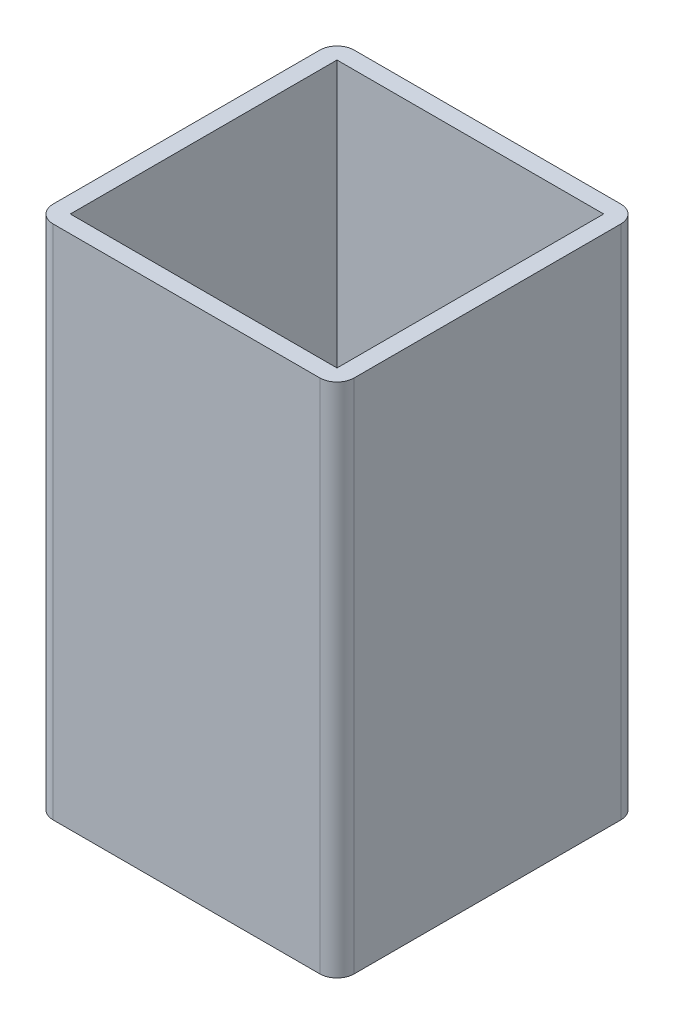
ISO-10303-21;
HEADER;
FILE_DESCRIPTION(('STEP AP214'),'2;1');
FILE_NAME('part.step','',(''),(''),'','','');
FILE_SCHEMA(('AUTOMOTIVE_DESIGN { 1 0 10303 214 1 1 1 1 }'));
ENDSEC;
DATA;
#1=APPLICATION_CONTEXT('core data for automotive mechanical design processes');
#2=APPLICATION_PROTOCOL_DEFINITION('international standard','automotive_design',2000,#1);
#3=PRODUCT_CONTEXT('',#1,'mechanical');
#4=PRODUCT('Part','Part','',(#3));
#5=PRODUCT_RELATED_PRODUCT_CATEGORY('part','',(#4));
#6=PRODUCT_DEFINITION_FORMATION('','',#4);
#7=PRODUCT_DEFINITION_CONTEXT('part definition',#1,'design');
#8=PRODUCT_DEFINITION('design','',#6,#7);
#9=PRODUCT_DEFINITION_SHAPE('','',#8);
#10=(LENGTH_UNIT() NAMED_UNIT(*) SI_UNIT(.MILLI.,.METRE.));
#11=(NAMED_UNIT(*) PLANE_ANGLE_UNIT() SI_UNIT($,.RADIAN.));
#12=(NAMED_UNIT(*) SI_UNIT($,.STERADIAN.) SOLID_ANGLE_UNIT());
#13=UNCERTAINTY_MEASURE_WITH_UNIT(LENGTH_MEASURE(1.E-05),#10,'distance_accuracy_value','');
#14=(GEOMETRIC_REPRESENTATION_CONTEXT(3) GLOBAL_UNCERTAINTY_ASSIGNED_CONTEXT((#13)) GLOBAL_UNIT_ASSIGNED_CONTEXT((#10,
#11,#12)) REPRESENTATION_CONTEXT('',''));
#15=CARTESIAN_POINT('',(0.,0.,0.));
#16=DIRECTION('',(0.,0.,1.));
#17=DIRECTION('',(1.,0.,0.));
#18=AXIS2_PLACEMENT_3D('',#15,#16,#17);
#19=CARTESIAN_POINT('',(7.5,60.,-17.5));
#20=DIRECTION('',(0.,-1.,0.));
#21=DIRECTION('',(0.,0.,-1.));
#22=AXIS2_PLACEMENT_3D('',#19,#20,#21);
#23=CYLINDRICAL_SURFACE('',#22,4.75);
#24=CARTESIAN_POINT('',(7.5,0.,-17.5));
#25=DIRECTION('',(0.,1.,0.));
#26=DIRECTION('',(0.,0.,1.));
#27=AXIS2_PLACEMENT_3D('',#24,#25,#26);
#28=CIRCLE('',#27,4.75);
#29=CARTESIAN_POINT('',(7.5,0.,-12.75));
#30=VERTEX_POINT('',#29);
#31=EDGE_CURVE('E155',#30,#30,#28,.T.);
#32=ORIENTED_EDGE('',*,*,#31,.F.);
#33=EDGE_LOOP('',(#32));
#34=FACE_BOUND('',#33,.T.);
#35=CARTESIAN_POINT('',(7.5,5.,-17.5));
#36=DIRECTION('',(0.,1.,0.));
#37=DIRECTION('',(0.,0.,1.));
#38=AXIS2_PLACEMENT_3D('',#35,#36,#37);
#39=CIRCLE('',#38,4.75);
#40=CARTESIAN_POINT('',(7.5,5.,-12.75));
#41=VERTEX_POINT('',#40);
#42=EDGE_CURVE('E207',#41,#41,#39,.T.);
#43=ORIENTED_EDGE('',*,*,#42,.T.);
#44=EDGE_LOOP('',(#43));
#45=FACE_BOUND('',#44,.T.);
#46=ADVANCED_FACE('F41',(#34,#45),#23,.F.);
#47=CARTESIAN_POINT('',(27.5,60.,-17.5));
#48=DIRECTION('',(0.,-1.,0.));
#49=DIRECTION('',(0.,0.,-1.));
#50=AXIS2_PLACEMENT_3D('',#47,#48,#49);
#51=CYLINDRICAL_SURFACE('',#50,4.75);
#52=CARTESIAN_POINT('',(27.5,0.,-17.5));
#53=DIRECTION('',(0.,1.,0.));
#54=DIRECTION('',(0.,0.,-1.));
#55=AXIS2_PLACEMENT_3D('',#52,#53,#54);
#56=CIRCLE('',#55,4.75);
#57=CARTESIAN_POINT('',(27.5,0.,-22.25));
#58=VERTEX_POINT('',#57);
#59=EDGE_CURVE('E204',#58,#58,#56,.T.);
#60=ORIENTED_EDGE('',*,*,#59,.F.);
#61=EDGE_LOOP('',(#60));
#62=FACE_BOUND('',#61,.T.);
#63=CARTESIAN_POINT('',(27.5,5.,-17.5));
#64=DIRECTION('',(0.,1.,0.));
#65=DIRECTION('',(0.,0.,1.));
#66=AXIS2_PLACEMENT_3D('',#63,#64,#65);
#67=CIRCLE('',#66,4.75);
#68=CARTESIAN_POINT('',(27.5,5.,-12.75));
#69=VERTEX_POINT('',#68);
#70=EDGE_CURVE('E45',#69,#69,#67,.T.);
#71=ORIENTED_EDGE('',*,*,#70,.T.);
#72=EDGE_LOOP('',(#71));
#73=FACE_BOUND('',#72,.T.);
#74=ADVANCED_FACE('F282',(#62,#73),#51,.F.);
#75=CARTESIAN_POINT('',(2.,60.,-33.));
#76=DIRECTION('',(0.,1.,0.));
#77=DIRECTION('',(0.,0.,1.));
#78=AXIS2_PLACEMENT_3D('',#75,#76,#77);
#79=PLANE('',#78);
#80=DIRECTION('',(-1.,0.,0.));
#81=VECTOR('',#80,1.);
#82=CARTESIAN_POINT('',(33.,60.,-33.));
#83=LINE('',#82,#81);
#84=CARTESIAN_POINT('',(33.,60.,-33.));
#85=VERTEX_POINT('',#84);
#86=CARTESIAN_POINT('',(2.,60.,-33.));
#87=VERTEX_POINT('',#86);
#88=EDGE_CURVE('E57',#85,#87,#83,.T.);
#89=ORIENTED_EDGE('',*,*,#88,.F.);
#90=DIRECTION('',(0.,0.,-1.));
#91=VECTOR('',#90,1.);
#92=CARTESIAN_POINT('',(33.,60.,-2.));
#93=LINE('',#92,#91);
#94=CARTESIAN_POINT('',(33.,60.,-2.));
#95=VERTEX_POINT('',#94);
#96=EDGE_CURVE('E217',#95,#85,#93,.T.);
#97=ORIENTED_EDGE('',*,*,#96,.F.);
#98=DIRECTION('',(1.,0.,0.));
#99=VECTOR('',#98,1.);
#100=CARTESIAN_POINT('',(2.,60.,-2.));
#101=LINE('',#100,#99);
#102=CARTESIAN_POINT('',(2.,60.,-2.));
#103=VERTEX_POINT('',#102);
#104=EDGE_CURVE('E228',#103,#95,#101,.T.);
#105=ORIENTED_EDGE('',*,*,#104,.F.);
#106=DIRECTION('',(0.,0.,1.));
#107=VECTOR('',#106,1.);
#108=CARTESIAN_POINT('',(2.,60.,-33.));
#109=LINE('',#108,#107);
#110=EDGE_CURVE('E231',#87,#103,#109,.T.);
#111=ORIENTED_EDGE('',*,*,#110,.F.);
#112=EDGE_LOOP('',(#89,#97,#105,#111));
#113=FACE_BOUND('',#112,.T.);
#114=CARTESIAN_POINT('',(2.,60.,-33.));
#115=DIRECTION('',(0.,1.,0.));
#116=DIRECTION('',(0.,0.,1.));
#117=AXIS2_PLACEMENT_3D('',#114,#115,#116);
#118=CIRCLE('',#117,2.);
#119=CARTESIAN_POINT('',(2.,60.,-35.));
#120=VERTEX_POINT('',#119);
#121=CARTESIAN_POINT('',(0.,60.,-33.));
#122=VERTEX_POINT('',#121);
#123=EDGE_CURVE('E167',#120,#122,#118,.T.);
#124=ORIENTED_EDGE('',*,*,#123,.T.);
#125=DIRECTION('',(0.,0.,1.));
#126=VECTOR('',#125,1.);
#127=CARTESIAN_POINT('',(0.,60.,-2.00000000000001));
#128=LINE('',#127,#126);
#129=CARTESIAN_POINT('',(0.,60.,-2.00000000000001));
#130=VERTEX_POINT('',#129);
#131=EDGE_CURVE('E107',#122,#130,#128,.T.);
#132=ORIENTED_EDGE('',*,*,#131,.T.);
#133=CARTESIAN_POINT('',(2.,60.,-2.));
#134=DIRECTION('',(0.,1.,0.));
#135=DIRECTION('',(0.,0.,1.));
#136=AXIS2_PLACEMENT_3D('',#133,#134,#135);
#137=CIRCLE('',#136,2.);
#138=CARTESIAN_POINT('',(2.00000000000001,60.,0.));
#139=VERTEX_POINT('',#138);
#140=EDGE_CURVE('E183',#130,#139,#137,.T.);
#141=ORIENTED_EDGE('',*,*,#140,.T.);
#142=DIRECTION('',(1.,0.,0.));
#143=VECTOR('',#142,1.);
#144=CARTESIAN_POINT('',(2.00000000000001,60.,0.));
#145=LINE('',#144,#143);
#146=CARTESIAN_POINT('',(33.,60.,0.));
#147=VERTEX_POINT('',#146);
#148=EDGE_CURVE('E196',#139,#147,#145,.T.);
#149=ORIENTED_EDGE('',*,*,#148,.T.);
#150=CARTESIAN_POINT('',(33.,60.,-2.));
#151=DIRECTION('',(0.,1.,0.));
#152=DIRECTION('',(0.,0.,-1.));
#153=AXIS2_PLACEMENT_3D('',#150,#151,#152);
#154=CIRCLE('',#153,2.);
#155=CARTESIAN_POINT('',(35.,60.,-2.00000000000001));
#156=VERTEX_POINT('',#155);
#157=EDGE_CURVE('E130',#147,#156,#154,.T.);
#158=ORIENTED_EDGE('',*,*,#157,.T.);
#159=DIRECTION('',(0.,0.,-1.));
#160=VECTOR('',#159,1.);
#161=CARTESIAN_POINT('',(35.,60.,-2.00000000000001));
#162=LINE('',#161,#160);
#163=CARTESIAN_POINT('',(35.,60.,-33.));
#164=VERTEX_POINT('',#163);
#165=EDGE_CURVE('E123',#156,#164,#162,.T.);
#166=ORIENTED_EDGE('',*,*,#165,.T.);
#167=CARTESIAN_POINT('',(33.,60.,-33.));
#168=DIRECTION('',(0.,1.,0.));
#169=DIRECTION('',(0.,0.,-1.));
#170=AXIS2_PLACEMENT_3D('',#167,#168,#169);
#171=CIRCLE('',#170,2.);
#172=CARTESIAN_POINT('',(33.,60.,-35.));
#173=VERTEX_POINT('',#172);
#174=EDGE_CURVE('E127',#164,#173,#171,.T.);
#175=ORIENTED_EDGE('',*,*,#174,.T.);
#176=DIRECTION('',(-1.,0.,0.));
#177=VECTOR('',#176,1.);
#178=CARTESIAN_POINT('',(2.,60.,-35.));
#179=LINE('',#178,#177);
#180=EDGE_CURVE('E66',#173,#120,#179,.T.);
#181=ORIENTED_EDGE('',*,*,#180,.T.);
#182=EDGE_LOOP('',(#124,#132,#141,#149,#158,#166,#175,#181));
#183=FACE_BOUND('',#182,.T.);
#184=ADVANCED_FACE('F125',(#113,#183),#79,.T.);
#185=CARTESIAN_POINT('',(2.,0.,-33.));
#186=DIRECTION('',(0.,1.,0.));
#187=DIRECTION('',(0.,0.,1.));
#188=AXIS2_PLACEMENT_3D('',#185,#186,#187);
#189=PLANE('',#188);
#190=CARTESIAN_POINT('',(2.,0.,-33.));
#191=DIRECTION('',(0.,1.,0.));
#192=DIRECTION('',(0.,0.,1.));
#193=AXIS2_PLACEMENT_3D('',#190,#191,#192);
#194=CIRCLE('',#193,2.);
#195=CARTESIAN_POINT('',(2.,0.,-35.));
#196=VERTEX_POINT('',#195);
#197=CARTESIAN_POINT('',(0.,0.,-33.));
#198=VERTEX_POINT('',#197);
#199=EDGE_CURVE('E151',#196,#198,#194,.T.);
#200=ORIENTED_EDGE('',*,*,#199,.F.);
#201=DIRECTION('',(-1.,0.,0.));
#202=VECTOR('',#201,1.);
#203=CARTESIAN_POINT('',(2.,0.,-35.));
#204=LINE('',#203,#202);
#205=CARTESIAN_POINT('',(33.,0.,-35.));
#206=VERTEX_POINT('',#205);
#207=EDGE_CURVE('E99',#206,#196,#204,.T.);
#208=ORIENTED_EDGE('',*,*,#207,.F.);
#209=CARTESIAN_POINT('',(33.,0.,-33.));
#210=DIRECTION('',(0.,1.,0.));
#211=DIRECTION('',(0.,0.,-1.));
#212=AXIS2_PLACEMENT_3D('',#209,#210,#211);
#213=CIRCLE('',#212,2.);
#214=CARTESIAN_POINT('',(35.,0.,-33.));
#215=VERTEX_POINT('',#214);
#216=EDGE_CURVE('E164',#215,#206,#213,.T.);
#217=ORIENTED_EDGE('',*,*,#216,.F.);
#218=DIRECTION('',(0.,0.,-1.));
#219=VECTOR('',#218,1.);
#220=CARTESIAN_POINT('',(35.,0.,-2.00000000000001));
#221=LINE('',#220,#219);
#222=CARTESIAN_POINT('',(35.,0.,-2.00000000000001));
#223=VERTEX_POINT('',#222);
#224=EDGE_CURVE('E139',#223,#215,#221,.T.);
#225=ORIENTED_EDGE('',*,*,#224,.F.);
#226=CARTESIAN_POINT('',(33.,0.,-2.));
#227=DIRECTION('',(0.,1.,0.));
#228=DIRECTION('',(0.,0.,-1.));
#229=AXIS2_PLACEMENT_3D('',#226,#227,#228);
#230=CIRCLE('',#229,2.);
#231=CARTESIAN_POINT('',(33.,0.,0.));
#232=VERTEX_POINT('',#231);
#233=EDGE_CURVE('E161',#232,#223,#230,.T.);
#234=ORIENTED_EDGE('',*,*,#233,.F.);
#235=DIRECTION('',(1.,0.,0.));
#236=VECTOR('',#235,1.);
#237=CARTESIAN_POINT('',(2.00000000000001,0.,0.));
#238=LINE('',#237,#236);
#239=CARTESIAN_POINT('',(2.00000000000001,0.,0.));
#240=VERTEX_POINT('',#239);
#241=EDGE_CURVE('E159',#240,#232,#238,.T.);
#242=ORIENTED_EDGE('',*,*,#241,.F.);
#243=CARTESIAN_POINT('',(2.,0.,-2.));
#244=DIRECTION('',(0.,1.,0.));
#245=DIRECTION('',(0.,0.,1.));
#246=AXIS2_PLACEMENT_3D('',#243,#244,#245);
#247=CIRCLE('',#246,2.);
#248=CARTESIAN_POINT('',(0.,0.,-2.00000000000001));
#249=VERTEX_POINT('',#248);
#250=EDGE_CURVE('E157',#249,#240,#247,.T.);
#251=ORIENTED_EDGE('',*,*,#250,.F.);
#252=DIRECTION('',(0.,0.,1.));
#253=VECTOR('',#252,1.);
#254=CARTESIAN_POINT('',(0.,0.,-2.00000000000001));
#255=LINE('',#254,#253);
#256=EDGE_CURVE('E154',#198,#249,#255,.T.);
#257=ORIENTED_EDGE('',*,*,#256,.F.);
#258=EDGE_LOOP('',(#200,#208,#217,#225,#234,#242,#251,#257));
#259=FACE_BOUND('',#258,.T.);
#260=ORIENTED_EDGE('',*,*,#31,.T.);
#261=EDGE_LOOP('',(#260));
#262=FACE_BOUND('',#261,.T.);
#263=ORIENTED_EDGE('',*,*,#59,.T.);
#264=EDGE_LOOP('',(#263));
#265=FACE_BOUND('',#264,.T.);
#266=ADVANCED_FACE('F187',(#259,#262,#265),#189,.F.);
#267=CARTESIAN_POINT('',(2.,60.,-33.));
#268=DIRECTION('',(0.,-1.,0.));
#269=DIRECTION('',(0.,0.,-1.));
#270=AXIS2_PLACEMENT_3D('',#267,#268,#269);
#271=CYLINDRICAL_SURFACE('',#270,2.);
#272=ORIENTED_EDGE('',*,*,#199,.T.);
#273=DIRECTION('',(0.,-1.,0.));
#274=VECTOR('',#273,1.);
#275=CARTESIAN_POINT('',(0.,60.,-33.));
#276=LINE('',#275,#274);
#277=EDGE_CURVE('E12',#122,#198,#276,.T.);
#278=ORIENTED_EDGE('',*,*,#277,.F.);
#279=ORIENTED_EDGE('',*,*,#123,.F.);
#280=DIRECTION('',(0.,-1.,0.));
#281=VECTOR('',#280,1.);
#282=CARTESIAN_POINT('',(2.,60.,-35.));
#283=LINE('',#282,#281);
#284=EDGE_CURVE('E147',#120,#196,#283,.T.);
#285=ORIENTED_EDGE('',*,*,#284,.T.);
#286=EDGE_LOOP('',(#272,#278,#279,#285));
#287=FACE_BOUND('',#286,.T.);
#288=ADVANCED_FACE('F43',(#287),#271,.T.);
#289=CARTESIAN_POINT('',(0.,60.,-2.00000000000001));
#290=DIRECTION('',(1.,0.,0.));
#291=DIRECTION('',(0.,0.,-1.));
#292=AXIS2_PLACEMENT_3D('',#289,#290,#291);
#293=PLANE('',#292);
#294=ORIENTED_EDGE('',*,*,#256,.T.);
#295=DIRECTION('',(0.,-1.,0.));
#296=VECTOR('',#295,1.);
#297=CARTESIAN_POINT('',(0.,60.,-2.00000000000001));
#298=LINE('',#297,#296);
#299=EDGE_CURVE('E50',#130,#249,#298,.T.);
#300=ORIENTED_EDGE('',*,*,#299,.F.);
#301=ORIENTED_EDGE('',*,*,#131,.F.);
#302=ORIENTED_EDGE('',*,*,#277,.T.);
#303=EDGE_LOOP('',(#294,#300,#301,#302));
#304=FACE_BOUND('',#303,.T.);
#305=ADVANCED_FACE('F308',(#304),#293,.F.);
#306=CARTESIAN_POINT('',(2.,60.,-2.));
#307=DIRECTION('',(0.,-1.,0.));
#308=DIRECTION('',(0.,0.,-1.));
#309=AXIS2_PLACEMENT_3D('',#306,#307,#308);
#310=CYLINDRICAL_SURFACE('',#309,2.);
#311=ORIENTED_EDGE('',*,*,#250,.T.);
#312=DIRECTION('',(0.,-1.,0.));
#313=VECTOR('',#312,1.);
#314=CARTESIAN_POINT('',(2.00000000000001,60.,0.));
#315=LINE('',#314,#313);
#316=EDGE_CURVE('E174',#139,#240,#315,.T.);
#317=ORIENTED_EDGE('',*,*,#316,.F.);
#318=ORIENTED_EDGE('',*,*,#140,.F.);
#319=ORIENTED_EDGE('',*,*,#299,.T.);
#320=EDGE_LOOP('',(#311,#317,#318,#319));
#321=FACE_BOUND('',#320,.T.);
#322=ADVANCED_FACE('F181',(#321),#310,.T.);
#323=CARTESIAN_POINT('',(2.00000000000001,60.,0.));
#324=DIRECTION('',(0.,0.,-1.));
#325=DIRECTION('',(-1.,0.,0.));
#326=AXIS2_PLACEMENT_3D('',#323,#324,#325);
#327=PLANE('',#326);
#328=ORIENTED_EDGE('',*,*,#241,.T.);
#329=DIRECTION('',(0.,-1.,0.));
#330=VECTOR('',#329,1.);
#331=CARTESIAN_POINT('',(33.,60.,0.));
#332=LINE('',#331,#330);
#333=EDGE_CURVE('E171',#147,#232,#332,.T.);
#334=ORIENTED_EDGE('',*,*,#333,.F.);
#335=ORIENTED_EDGE('',*,*,#148,.F.);
#336=ORIENTED_EDGE('',*,*,#316,.T.);
#337=EDGE_LOOP('',(#328,#334,#335,#336));
#338=FACE_BOUND('',#337,.T.);
#339=ADVANCED_FACE('F192',(#338),#327,.F.);
#340=CARTESIAN_POINT('',(33.,60.,-2.));
#341=DIRECTION('',(0.,-1.,0.));
#342=DIRECTION('',(0.,0.,-1.));
#343=AXIS2_PLACEMENT_3D('',#340,#341,#342);
#344=CYLINDRICAL_SURFACE('',#343,2.);
#345=ORIENTED_EDGE('',*,*,#233,.T.);
#346=DIRECTION('',(0.,-1.,0.));
#347=VECTOR('',#346,1.);
#348=CARTESIAN_POINT('',(35.,60.,-2.00000000000001));
#349=LINE('',#348,#347);
#350=EDGE_CURVE('E142',#156,#223,#349,.T.);
#351=ORIENTED_EDGE('',*,*,#350,.F.);
#352=ORIENTED_EDGE('',*,*,#157,.F.);
#353=ORIENTED_EDGE('',*,*,#333,.T.);
#354=EDGE_LOOP('',(#345,#351,#352,#353));
#355=FACE_BOUND('',#354,.T.);
#356=ADVANCED_FACE('F195',(#355),#344,.T.);
#357=CARTESIAN_POINT('',(35.,60.,-2.00000000000001));
#358=DIRECTION('',(-1.,0.,0.));
#359=DIRECTION('',(0.,0.,1.));
#360=AXIS2_PLACEMENT_3D('',#357,#358,#359);
#361=PLANE('',#360);
#362=ORIENTED_EDGE('',*,*,#224,.T.);
#363=DIRECTION('',(0.,-1.,0.));
#364=VECTOR('',#363,1.);
#365=CARTESIAN_POINT('',(35.,60.,-33.));
#366=LINE('',#365,#364);
#367=EDGE_CURVE('E136',#164,#215,#366,.T.);
#368=ORIENTED_EDGE('',*,*,#367,.F.);
#369=ORIENTED_EDGE('',*,*,#165,.F.);
#370=ORIENTED_EDGE('',*,*,#350,.T.);
#371=EDGE_LOOP('',(#362,#368,#369,#370));
#372=FACE_BOUND('',#371,.T.);
#373=ADVANCED_FACE('F137',(#372),#361,.F.);
#374=CARTESIAN_POINT('',(33.,60.,-33.));
#375=DIRECTION('',(0.,-1.,0.));
#376=DIRECTION('',(0.,0.,-1.));
#377=AXIS2_PLACEMENT_3D('',#374,#375,#376);
#378=CYLINDRICAL_SURFACE('',#377,2.);
#379=ORIENTED_EDGE('',*,*,#216,.T.);
#380=DIRECTION('',(0.,-1.,0.));
#381=VECTOR('',#380,1.);
#382=CARTESIAN_POINT('',(33.,60.,-35.));
#383=LINE('',#382,#381);
#384=EDGE_CURVE('E143',#173,#206,#383,.T.);
#385=ORIENTED_EDGE('',*,*,#384,.F.);
#386=ORIENTED_EDGE('',*,*,#174,.F.);
#387=ORIENTED_EDGE('',*,*,#367,.T.);
#388=EDGE_LOOP('',(#379,#385,#386,#387));
#389=FACE_BOUND('',#388,.T.);
#390=ADVANCED_FACE('F145',(#389),#378,.T.);
#391=CARTESIAN_POINT('',(2.,60.,-35.));
#392=DIRECTION('',(0.,0.,1.));
#393=DIRECTION('',(1.,0.,0.));
#394=AXIS2_PLACEMENT_3D('',#391,#392,#393);
#395=PLANE('',#394);
#396=ORIENTED_EDGE('',*,*,#207,.T.);
#397=ORIENTED_EDGE('',*,*,#284,.F.);
#398=ORIENTED_EDGE('',*,*,#180,.F.);
#399=ORIENTED_EDGE('',*,*,#384,.T.);
#400=EDGE_LOOP('',(#396,#397,#398,#399));
#401=FACE_BOUND('',#400,.T.);
#402=ADVANCED_FACE('F278',(#401),#395,.F.);
#403=CARTESIAN_POINT('',(33.,-43.840620433566,-33.));
#404=DIRECTION('',(0.,0.,-1.));
#405=DIRECTION('',(-1.,0.,0.));
#406=AXIS2_PLACEMENT_3D('',#403,#404,#405);
#407=PLANE('',#406);
#408=DIRECTION('',(1.,0.,0.));
#409=VECTOR('',#408,1.);
#410=CARTESIAN_POINT('',(33.,5.,-33.));
#411=LINE('',#410,#409);
#412=CARTESIAN_POINT('',(2.,5.,-33.));
#413=VERTEX_POINT('',#412);
#414=CARTESIAN_POINT('',(33.,5.,-33.));
#415=VERTEX_POINT('',#414);
#416=EDGE_CURVE('E213',#413,#415,#411,.T.);
#417=ORIENTED_EDGE('',*,*,#416,.T.);
#418=DIRECTION('',(0.,1.,0.));
#419=VECTOR('',#418,1.);
#420=CARTESIAN_POINT('',(33.,-43.840620433566,-33.));
#421=LINE('',#420,#419);
#422=EDGE_CURVE('E223',#415,#85,#421,.T.);
#423=ORIENTED_EDGE('',*,*,#422,.T.);
#424=ORIENTED_EDGE('',*,*,#88,.T.);
#425=DIRECTION('',(0.,1.,0.));
#426=VECTOR('',#425,1.);
#427=CARTESIAN_POINT('',(2.,-43.840620433566,-33.));
#428=LINE('',#427,#426);
#429=EDGE_CURVE('E214',#413,#87,#428,.T.);
#430=ORIENTED_EDGE('',*,*,#429,.F.);
#431=EDGE_LOOP('',(#417,#423,#424,#430));
#432=FACE_BOUND('',#431,.T.);
#433=ADVANCED_FACE('F262',(#432),#407,.F.);
#434=CARTESIAN_POINT('',(33.,-43.840620433566,-2.));
#435=DIRECTION('',(1.,0.,0.));
#436=DIRECTION('',(0.,0.,-1.));
#437=AXIS2_PLACEMENT_3D('',#434,#435,#436);
#438=PLANE('',#437);
#439=DIRECTION('',(0.,0.,1.));
#440=VECTOR('',#439,1.);
#441=CARTESIAN_POINT('',(33.,5.,-2.));
#442=LINE('',#441,#440);
#443=CARTESIAN_POINT('',(33.,5.,-2.));
#444=VERTEX_POINT('',#443);
#445=EDGE_CURVE('E237',#415,#444,#442,.T.);
#446=ORIENTED_EDGE('',*,*,#445,.T.);
#447=DIRECTION('',(0.,1.,0.));
#448=VECTOR('',#447,1.);
#449=CARTESIAN_POINT('',(33.,-43.840620433566,-2.));
#450=LINE('',#449,#448);
#451=EDGE_CURVE('E220',#444,#95,#450,.T.);
#452=ORIENTED_EDGE('',*,*,#451,.T.);
#453=ORIENTED_EDGE('',*,*,#96,.T.);
#454=ORIENTED_EDGE('',*,*,#422,.F.);
#455=EDGE_LOOP('',(#446,#452,#453,#454));
#456=FACE_BOUND('',#455,.T.);
#457=ADVANCED_FACE('F270',(#456),#438,.F.);
#458=CARTESIAN_POINT('',(2.,-43.840620433566,-2.));
#459=DIRECTION('',(0.,0.,1.));
#460=DIRECTION('',(1.,0.,0.));
#461=AXIS2_PLACEMENT_3D('',#458,#459,#460);
#462=PLANE('',#461);
#463=DIRECTION('',(-1.,0.,0.));
#464=VECTOR('',#463,1.);
#465=CARTESIAN_POINT('',(2.,5.,-2.));
#466=LINE('',#465,#464);
#467=CARTESIAN_POINT('',(2.,4.99999999999998,-2.));
#468=VERTEX_POINT('',#467);
#469=EDGE_CURVE('E225',#444,#468,#466,.T.);
#470=ORIENTED_EDGE('',*,*,#469,.T.);
#471=DIRECTION('',(0.,1.,0.));
#472=VECTOR('',#471,1.);
#473=CARTESIAN_POINT('',(2.,-43.840620433566,-2.));
#474=LINE('',#473,#472);
#475=EDGE_CURVE('E216',#468,#103,#474,.T.);
#476=ORIENTED_EDGE('',*,*,#475,.T.);
#477=ORIENTED_EDGE('',*,*,#104,.T.);
#478=ORIENTED_EDGE('',*,*,#451,.F.);
#479=EDGE_LOOP('',(#470,#476,#477,#478));
#480=FACE_BOUND('',#479,.T.);
#481=ADVANCED_FACE('F246',(#480),#462,.F.);
#482=CARTESIAN_POINT('',(2.,-43.840620433566,-33.));
#483=DIRECTION('',(-1.,0.,0.));
#484=DIRECTION('',(0.,0.,1.));
#485=AXIS2_PLACEMENT_3D('',#482,#483,#484);
#486=PLANE('',#485);
#487=DIRECTION('',(0.,0.,-1.));
#488=VECTOR('',#487,1.);
#489=CARTESIAN_POINT('',(2.,5.,-33.));
#490=LINE('',#489,#488);
#491=EDGE_CURVE('E210',#468,#413,#490,.T.);
#492=ORIENTED_EDGE('',*,*,#491,.T.);
#493=ORIENTED_EDGE('',*,*,#429,.T.);
#494=ORIENTED_EDGE('',*,*,#110,.T.);
#495=ORIENTED_EDGE('',*,*,#475,.F.);
#496=EDGE_LOOP('',(#492,#493,#494,#495));
#497=FACE_BOUND('',#496,.T.);
#498=ADVANCED_FACE('F255',(#497),#486,.F.);
#499=CARTESIAN_POINT('',(2.,5.,-33.));
#500=DIRECTION('',(0.,1.,0.));
#501=DIRECTION('',(0.,0.,1.));
#502=AXIS2_PLACEMENT_3D('',#499,#500,#501);
#503=PLANE('',#502);
#504=ORIENTED_EDGE('',*,*,#42,.F.);
#505=EDGE_LOOP('',(#504));
#506=FACE_BOUND('',#505,.T.);
#507=ORIENTED_EDGE('',*,*,#70,.F.);
#508=EDGE_LOOP('',(#507));
#509=FACE_BOUND('',#508,.T.);
#510=ORIENTED_EDGE('',*,*,#416,.F.);
#511=ORIENTED_EDGE('',*,*,#491,.F.);
#512=ORIENTED_EDGE('',*,*,#469,.F.);
#513=ORIENTED_EDGE('',*,*,#445,.F.);
#514=EDGE_LOOP('',(#510,#511,#512,#513));
#515=FACE_BOUND('',#514,.T.);
#516=ADVANCED_FACE('F259',(#506,#509,#515),#503,.T.);
#517=CLOSED_SHELL('',(#46,#74,#184,#266,#288,#305,#322,#339,#356,#373,#390,#402,#433,#457,#481,
#498,#516));
#518=MANIFOLD_SOLID_BREP('B2',#517);
#519=ADVANCED_BREP_SHAPE_REPRESENTATION('',(#18,#518),#14);
#520=SHAPE_DEFINITION_REPRESENTATION(#9,#519);
ENDSEC;
END-ISO-10303-21;
